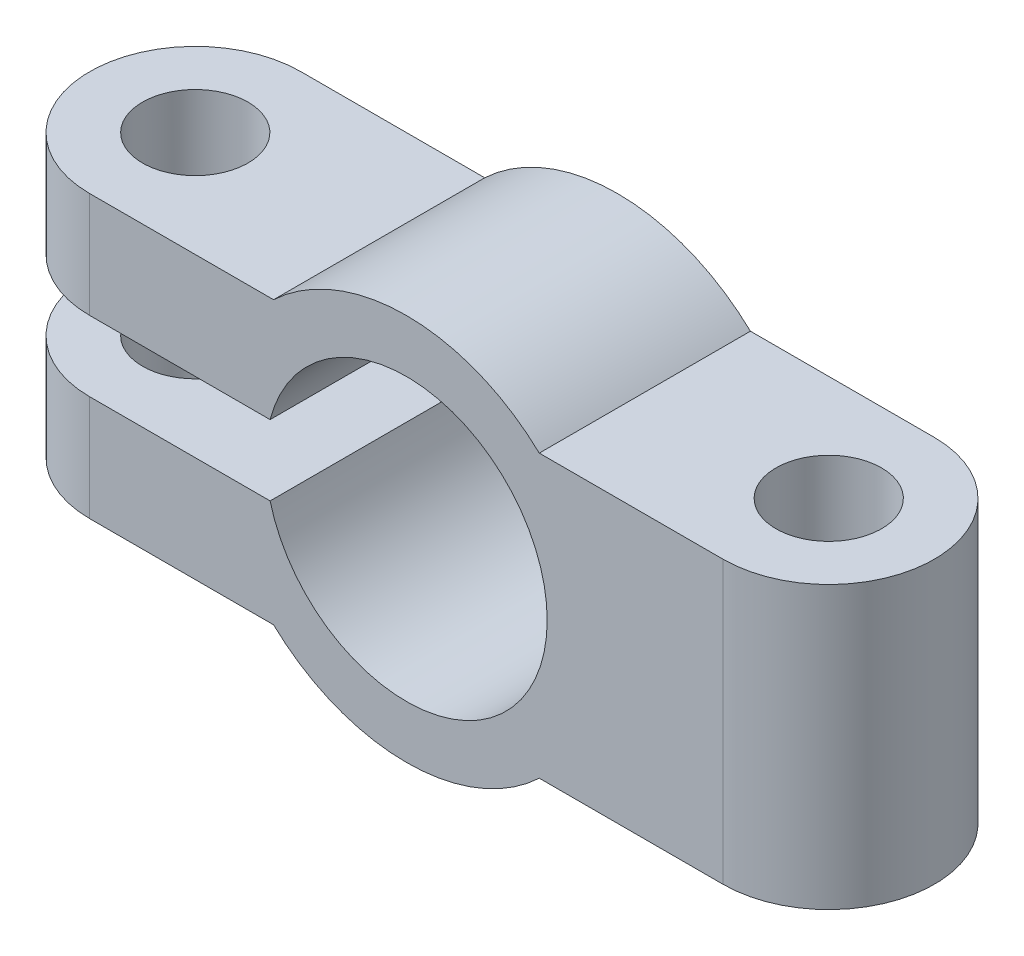
ISO-10303-21;
HEADER;
FILE_DESCRIPTION(('STEP AP214'),'2;1');
FILE_NAME('part.step','',(''),(''),'','','');
FILE_SCHEMA(('AUTOMOTIVE_DESIGN { 1 0 10303 214 1 1 1 1 }'));
ENDSEC;
DATA;
#1=APPLICATION_CONTEXT('core data for automotive mechanical design processes');
#2=APPLICATION_PROTOCOL_DEFINITION('international standard','automotive_design',2000,#1);
#3=PRODUCT_CONTEXT('',#1,'mechanical');
#4=PRODUCT('Part','Part','',(#3));
#5=PRODUCT_RELATED_PRODUCT_CATEGORY('part','',(#4));
#6=PRODUCT_DEFINITION_FORMATION('','',#4);
#7=PRODUCT_DEFINITION_CONTEXT('part definition',#1,'design');
#8=PRODUCT_DEFINITION('design','',#6,#7);
#9=PRODUCT_DEFINITION_SHAPE('','',#8);
#10=(LENGTH_UNIT() NAMED_UNIT(*) SI_UNIT(.MILLI.,.METRE.));
#11=(NAMED_UNIT(*) PLANE_ANGLE_UNIT() SI_UNIT($,.RADIAN.));
#12=(NAMED_UNIT(*) SI_UNIT($,.STERADIAN.) SOLID_ANGLE_UNIT());
#13=UNCERTAINTY_MEASURE_WITH_UNIT(LENGTH_MEASURE(1.E-05),#10,'distance_accuracy_value','');
#14=(GEOMETRIC_REPRESENTATION_CONTEXT(3) GLOBAL_UNCERTAINTY_ASSIGNED_CONTEXT((#13)) GLOBAL_UNIT_ASSIGNED_CONTEXT((#10,
#11,#12)) REPRESENTATION_CONTEXT('',''));
#15=CARTESIAN_POINT('',(0.,0.,0.));
#16=DIRECTION('',(0.,0.,1.));
#17=DIRECTION('',(1.,0.,0.));
#18=AXIS2_PLACEMENT_3D('',#15,#16,#17);
#19=CARTESIAN_POINT('',(12.,4.,6.));
#20=DIRECTION('',(0.,-1.,0.));
#21=DIRECTION('',(0.,0.,-1.));
#22=AXIS2_PLACEMENT_3D('',#19,#20,#21);
#23=PLANE('',#22);
#24=CARTESIAN_POINT('',(9.00000000000001,4.,3.));
#25=DIRECTION('',(0.,-1.,0.));
#26=DIRECTION('',(0.,0.,-1.));
#27=AXIS2_PLACEMENT_3D('',#24,#25,#26);
#28=CIRCLE('',#27,1.5);
#29=CARTESIAN_POINT('',(9.00000000000001,4.,1.5));
#30=VERTEX_POINT('',#29);
#31=EDGE_CURVE('E246',#30,#30,#28,.T.);
#32=ORIENTED_EDGE('',*,*,#31,.T.);
#33=EDGE_LOOP('',(#32));
#34=FACE_BOUND('',#33,.T.);
#35=DIRECTION('',(-1.,0.,0.));
#36=VECTOR('',#35,1.);
#37=CARTESIAN_POINT('',(12.,4.,6.));
#38=LINE('',#37,#36);
#39=CARTESIAN_POINT('',(9.00000000000001,4.,6.));
#40=VERTEX_POINT('',#39);
#41=CARTESIAN_POINT('',(3.77491721763537,4.,6.));
#42=VERTEX_POINT('',#41);
#43=EDGE_CURVE('E170',#40,#42,#38,.T.);
#44=ORIENTED_EDGE('',*,*,#43,.F.);
#45=CARTESIAN_POINT('',(9.00000000000001,4.,3.));
#46=DIRECTION('',(0.,-1.,0.));
#47=DIRECTION('',(0.,0.,-1.));
#48=AXIS2_PLACEMENT_3D('',#45,#46,#47);
#49=CIRCLE('',#48,3.);
#50=CARTESIAN_POINT('',(9.00000000000001,4.,0.));
#51=VERTEX_POINT('',#50);
#52=EDGE_CURVE('E137',#51,#40,#49,.T.);
#53=ORIENTED_EDGE('',*,*,#52,.F.);
#54=DIRECTION('',(-1.,0.,0.));
#55=VECTOR('',#54,1.);
#56=CARTESIAN_POINT('',(12.,4.,0.));
#57=LINE('',#56,#55);
#58=CARTESIAN_POINT('',(3.77491721763537,4.,0.));
#59=VERTEX_POINT('',#58);
#60=EDGE_CURVE('E152',#51,#59,#57,.T.);
#61=ORIENTED_EDGE('',*,*,#60,.T.);
#62=DIRECTION('',(0.,0.,-1.));
#63=VECTOR('',#62,1.);
#64=CARTESIAN_POINT('',(3.77491721763537,4.,6.));
#65=LINE('',#64,#63);
#66=EDGE_CURVE('E183',#42,#59,#65,.T.);
#67=ORIENTED_EDGE('',*,*,#66,.F.);
#68=EDGE_LOOP('',(#44,#53,#61,#67));
#69=FACE_BOUND('',#68,.T.);
#70=ADVANCED_FACE('F34',(#34,#69),#23,.F.);
#71=CARTESIAN_POINT('',(12.,-4.,6.));
#72=DIRECTION('',(0.,1.,0.));
#73=DIRECTION('',(-1.,0.,0.));
#74=AXIS2_PLACEMENT_3D('',#71,#72,#73);
#75=PLANE('',#74);
#76=CARTESIAN_POINT('',(9.00000000000001,-4.,3.));
#77=DIRECTION('',(0.,-1.,0.));
#78=DIRECTION('',(0.,0.,-1.));
#79=AXIS2_PLACEMENT_3D('',#76,#77,#78);
#80=CIRCLE('',#79,1.5);
#81=CARTESIAN_POINT('',(9.00000000000001,-4.,1.5));
#82=VERTEX_POINT('',#81);
#83=EDGE_CURVE('E249',#82,#82,#80,.T.);
#84=ORIENTED_EDGE('',*,*,#83,.F.);
#85=EDGE_LOOP('',(#84));
#86=FACE_BOUND('',#85,.T.);
#87=CARTESIAN_POINT('',(9.00000000000001,-4.,3.));
#88=DIRECTION('',(0.,-1.,0.));
#89=DIRECTION('',(0.,0.,-1.));
#90=AXIS2_PLACEMENT_3D('',#87,#88,#89);
#91=CIRCLE('',#90,3.);
#92=CARTESIAN_POINT('',(9.00000000000001,-4.,0.));
#93=VERTEX_POINT('',#92);
#94=CARTESIAN_POINT('',(9.00000000000001,-4.,6.));
#95=VERTEX_POINT('',#94);
#96=EDGE_CURVE('E122',#93,#95,#91,.T.);
#97=ORIENTED_EDGE('',*,*,#96,.T.);
#98=DIRECTION('',(1.,0.,0.));
#99=VECTOR('',#98,1.);
#100=CARTESIAN_POINT('',(12.,-4.,6.));
#101=LINE('',#100,#99);
#102=CARTESIAN_POINT('',(3.77491721763537,-4.,6.));
#103=VERTEX_POINT('',#102);
#104=EDGE_CURVE('E126',#103,#95,#101,.T.);
#105=ORIENTED_EDGE('',*,*,#104,.F.);
#106=DIRECTION('',(0.,0.,-1.));
#107=VECTOR('',#106,1.);
#108=CARTESIAN_POINT('',(3.77491721763537,-4.,6.));
#109=LINE('',#108,#107);
#110=CARTESIAN_POINT('',(3.77491721763537,-4.,0.));
#111=VERTEX_POINT('',#110);
#112=EDGE_CURVE('E144',#103,#111,#109,.T.);
#113=ORIENTED_EDGE('',*,*,#112,.T.);
#114=DIRECTION('',(1.,0.,0.));
#115=VECTOR('',#114,1.);
#116=CARTESIAN_POINT('',(12.,-4.,0.));
#117=LINE('',#116,#115);
#118=EDGE_CURVE('E128',#111,#93,#117,.T.);
#119=ORIENTED_EDGE('',*,*,#118,.T.);
#120=EDGE_LOOP('',(#97,#105,#113,#119));
#121=FACE_BOUND('',#120,.T.);
#122=ADVANCED_FACE('F123',(#86,#121),#75,.F.);
#123=CARTESIAN_POINT('',(-12.,4.,6.));
#124=DIRECTION('',(0.,-1.,0.));
#125=DIRECTION('',(0.,0.,-1.));
#126=AXIS2_PLACEMENT_3D('',#123,#124,#125);
#127=PLANE('',#126);
#128=CARTESIAN_POINT('',(-9.,4.,3.));
#129=DIRECTION('',(0.,-1.,0.));
#130=DIRECTION('',(0.,0.,-1.));
#131=AXIS2_PLACEMENT_3D('',#128,#129,#130);
#132=CIRCLE('',#131,1.5);
#133=CARTESIAN_POINT('',(-9.,4.,1.5));
#134=VERTEX_POINT('',#133);
#135=EDGE_CURVE('E132',#134,#134,#132,.T.);
#136=ORIENTED_EDGE('',*,*,#135,.T.);
#137=EDGE_LOOP('',(#136));
#138=FACE_BOUND('',#137,.T.);
#139=CARTESIAN_POINT('',(-9.,4.,3.));
#140=DIRECTION('',(0.,-1.,0.));
#141=DIRECTION('',(0.,0.,-1.));
#142=AXIS2_PLACEMENT_3D('',#139,#140,#141);
#143=CIRCLE('',#142,3.);
#144=CARTESIAN_POINT('',(-9.,4.,6.));
#145=VERTEX_POINT('',#144);
#146=CARTESIAN_POINT('',(-9.,4.,0.));
#147=VERTEX_POINT('',#146);
#148=EDGE_CURVE('E48',#145,#147,#143,.T.);
#149=ORIENTED_EDGE('',*,*,#148,.F.);
#150=DIRECTION('',(-1.,0.,0.));
#151=VECTOR('',#150,1.);
#152=CARTESIAN_POINT('',(-12.,4.,6.));
#153=LINE('',#152,#151);
#154=CARTESIAN_POINT('',(-3.77491721763537,4.,6.));
#155=VERTEX_POINT('',#154);
#156=EDGE_CURVE('E222',#155,#145,#153,.T.);
#157=ORIENTED_EDGE('',*,*,#156,.F.);
#158=DIRECTION('',(0.,0.,-1.));
#159=VECTOR('',#158,1.);
#160=CARTESIAN_POINT('',(-3.77491721763537,4.,6.));
#161=LINE('',#160,#159);
#162=CARTESIAN_POINT('',(-3.77491721763537,4.,0.));
#163=VERTEX_POINT('',#162);
#164=EDGE_CURVE('E180',#155,#163,#161,.T.);
#165=ORIENTED_EDGE('',*,*,#164,.T.);
#166=DIRECTION('',(-1.,0.,0.));
#167=VECTOR('',#166,1.);
#168=CARTESIAN_POINT('',(-12.,4.,0.));
#169=LINE('',#168,#167);
#170=EDGE_CURVE('E156',#163,#147,#169,.T.);
#171=ORIENTED_EDGE('',*,*,#170,.T.);
#172=EDGE_LOOP('',(#149,#157,#165,#171));
#173=FACE_BOUND('',#172,.T.);
#174=ADVANCED_FACE('F257',(#138,#173),#127,.F.);
#175=CARTESIAN_POINT('',(-12.,1.,6.));
#176=DIRECTION('',(0.,1.,0.));
#177=DIRECTION('',(0.,0.,1.));
#178=AXIS2_PLACEMENT_3D('',#175,#176,#177);
#179=PLANE('',#178);
#180=CARTESIAN_POINT('',(-9.,1.,3.));
#181=DIRECTION('',(0.,1.,0.));
#182=DIRECTION('',(0.,0.,1.));
#183=AXIS2_PLACEMENT_3D('',#180,#181,#182);
#184=CIRCLE('',#183,1.5);
#185=CARTESIAN_POINT('',(-9.,1.,4.5));
#186=VERTEX_POINT('',#185);
#187=EDGE_CURVE('E237',#186,#186,#184,.T.);
#188=ORIENTED_EDGE('',*,*,#187,.T.);
#189=EDGE_LOOP('',(#188));
#190=FACE_BOUND('',#189,.T.);
#191=DIRECTION('',(1.,0.,0.));
#192=VECTOR('',#191,1.);
#193=CARTESIAN_POINT('',(-12.,1.,6.));
#194=LINE('',#193,#192);
#195=CARTESIAN_POINT('',(-9.,0.999999999999998,6.));
#196=VERTEX_POINT('',#195);
#197=CARTESIAN_POINT('',(-3.87298334620742,0.999999999999998,6.));
#198=VERTEX_POINT('',#197);
#199=EDGE_CURVE('E203',#196,#198,#194,.T.);
#200=ORIENTED_EDGE('',*,*,#199,.F.);
#201=CARTESIAN_POINT('',(-9.,1.,3.));
#202=DIRECTION('',(0.,1.,0.));
#203=DIRECTION('',(0.,0.,1.));
#204=AXIS2_PLACEMENT_3D('',#201,#202,#203);
#205=CIRCLE('',#204,3.);
#206=CARTESIAN_POINT('',(-9.,0.999999999999998,0.));
#207=VERTEX_POINT('',#206);
#208=EDGE_CURVE('E195',#207,#196,#205,.T.);
#209=ORIENTED_EDGE('',*,*,#208,.F.);
#210=DIRECTION('',(1.,0.,0.));
#211=VECTOR('',#210,1.);
#212=CARTESIAN_POINT('',(-12.,1.,0.));
#213=LINE('',#212,#211);
#214=CARTESIAN_POINT('',(-3.87298334620742,0.999999999999998,0.));
#215=VERTEX_POINT('',#214);
#216=EDGE_CURVE('E159',#207,#215,#213,.T.);
#217=ORIENTED_EDGE('',*,*,#216,.T.);
#218=DIRECTION('',(0.,0.,-1.));
#219=VECTOR('',#218,1.);
#220=CARTESIAN_POINT('',(-3.87298334620742,0.999999999999998,6.));
#221=LINE('',#220,#219);
#222=EDGE_CURVE('E177',#198,#215,#221,.T.);
#223=ORIENTED_EDGE('',*,*,#222,.F.);
#224=EDGE_LOOP('',(#200,#209,#217,#223));
#225=FACE_BOUND('',#224,.T.);
#226=ADVANCED_FACE('F201',(#190,#225),#179,.F.);
#227=CARTESIAN_POINT('',(-12.,-1.,6.));
#228=DIRECTION('',(0.,-1.,0.));
#229=DIRECTION('',(1.,0.,0.));
#230=AXIS2_PLACEMENT_3D('',#227,#228,#229);
#231=PLANE('',#230);
#232=CARTESIAN_POINT('',(-9.,-1.,3.));
#233=DIRECTION('',(0.,-1.,0.));
#234=DIRECTION('',(1.,0.,0.));
#235=AXIS2_PLACEMENT_3D('',#232,#233,#234);
#236=CIRCLE('',#235,1.5);
#237=CARTESIAN_POINT('',(-7.5,-1.,3.));
#238=VERTEX_POINT('',#237);
#239=EDGE_CURVE('E240',#238,#238,#236,.T.);
#240=ORIENTED_EDGE('',*,*,#239,.T.);
#241=EDGE_LOOP('',(#240));
#242=FACE_BOUND('',#241,.T.);
#243=CARTESIAN_POINT('',(-9.,-1.,3.));
#244=DIRECTION('',(0.,-1.,0.));
#245=DIRECTION('',(1.,0.,0.));
#246=AXIS2_PLACEMENT_3D('',#243,#244,#245);
#247=CIRCLE('',#246,3.);
#248=CARTESIAN_POINT('',(-9.,-1.,6.));
#249=VERTEX_POINT('',#248);
#250=CARTESIAN_POINT('',(-9.,-1.,0.));
#251=VERTEX_POINT('',#250);
#252=EDGE_CURVE('E56',#249,#251,#247,.T.);
#253=ORIENTED_EDGE('',*,*,#252,.F.);
#254=DIRECTION('',(-1.,0.,0.));
#255=VECTOR('',#254,1.);
#256=CARTESIAN_POINT('',(-12.,-1.,6.));
#257=LINE('',#256,#255);
#258=CARTESIAN_POINT('',(-3.87298334620742,-1.,6.));
#259=VERTEX_POINT('',#258);
#260=EDGE_CURVE('E216',#259,#249,#257,.T.);
#261=ORIENTED_EDGE('',*,*,#260,.F.);
#262=DIRECTION('',(0.,0.,-1.));
#263=VECTOR('',#262,1.);
#264=CARTESIAN_POINT('',(-3.87298334620742,-1.,6.));
#265=LINE('',#264,#263);
#266=CARTESIAN_POINT('',(-3.87298334620742,-1.,0.));
#267=VERTEX_POINT('',#266);
#268=EDGE_CURVE('E174',#259,#267,#265,.T.);
#269=ORIENTED_EDGE('',*,*,#268,.T.);
#270=DIRECTION('',(-1.,0.,0.));
#271=VECTOR('',#270,1.);
#272=CARTESIAN_POINT('',(-12.,-1.,0.));
#273=LINE('',#272,#271);
#274=EDGE_CURVE('E163',#267,#251,#273,.T.);
#275=ORIENTED_EDGE('',*,*,#274,.T.);
#276=EDGE_LOOP('',(#253,#261,#269,#275));
#277=FACE_BOUND('',#276,.T.);
#278=ADVANCED_FACE('F215',(#242,#277),#231,.F.);
#279=CARTESIAN_POINT('',(-12.,-4.,6.));
#280=DIRECTION('',(0.,1.,0.));
#281=DIRECTION('',(0.,0.,1.));
#282=AXIS2_PLACEMENT_3D('',#279,#280,#281);
#283=PLANE('',#282);
#284=CARTESIAN_POINT('',(-9.,-4.,3.));
#285=DIRECTION('',(0.,-1.,0.));
#286=DIRECTION('',(0.,0.,-1.));
#287=AXIS2_PLACEMENT_3D('',#284,#285,#286);
#288=CIRCLE('',#287,1.5);
#289=CARTESIAN_POINT('',(-9.,-4.,1.5));
#290=VERTEX_POINT('',#289);
#291=EDGE_CURVE('E243',#290,#290,#288,.T.);
#292=ORIENTED_EDGE('',*,*,#291,.F.);
#293=EDGE_LOOP('',(#292));
#294=FACE_BOUND('',#293,.T.);
#295=DIRECTION('',(1.,0.,0.));
#296=VECTOR('',#295,1.);
#297=CARTESIAN_POINT('',(-12.,-4.,6.));
#298=LINE('',#297,#296);
#299=CARTESIAN_POINT('',(-9.,-4.,6.));
#300=VERTEX_POINT('',#299);
#301=CARTESIAN_POINT('',(-3.77491721763537,-4.,6.));
#302=VERTEX_POINT('',#301);
#303=EDGE_CURVE('E148',#300,#302,#298,.T.);
#304=ORIENTED_EDGE('',*,*,#303,.F.);
#305=CARTESIAN_POINT('',(-9.,-4.,3.));
#306=DIRECTION('',(0.,-1.,0.));
#307=DIRECTION('',(0.,0.,-1.));
#308=AXIS2_PLACEMENT_3D('',#305,#306,#307);
#309=CIRCLE('',#308,3.);
#310=CARTESIAN_POINT('',(-9.,-4.,0.));
#311=VERTEX_POINT('',#310);
#312=EDGE_CURVE('E230',#300,#311,#309,.T.);
#313=ORIENTED_EDGE('',*,*,#312,.T.);
#314=DIRECTION('',(1.,0.,0.));
#315=VECTOR('',#314,1.);
#316=CARTESIAN_POINT('',(-12.,-4.,0.));
#317=LINE('',#316,#315);
#318=CARTESIAN_POINT('',(-3.77491721763537,-4.,0.));
#319=VERTEX_POINT('',#318);
#320=EDGE_CURVE('E166',#311,#319,#317,.T.);
#321=ORIENTED_EDGE('',*,*,#320,.T.);
#322=DIRECTION('',(0.,0.,-1.));
#323=VECTOR('',#322,1.);
#324=CARTESIAN_POINT('',(-3.77491721763537,-4.,6.));
#325=LINE('',#324,#323);
#326=EDGE_CURVE('E146',#302,#319,#325,.T.);
#327=ORIENTED_EDGE('',*,*,#326,.F.);
#328=EDGE_LOOP('',(#304,#313,#321,#327));
#329=FACE_BOUND('',#328,.T.);
#330=ADVANCED_FACE('F274',(#294,#329),#283,.F.);
#331=CARTESIAN_POINT('',(0.,0.,6.));
#332=DIRECTION('',(0.,0.,1.));
#333=DIRECTION('',(1.,0.,0.));
#334=AXIS2_PLACEMENT_3D('',#331,#332,#333);
#335=PLANE('',#334);
#336=DIRECTION('',(0.,-1.,0.));
#337=VECTOR('',#336,1.);
#338=CARTESIAN_POINT('',(9.00000000000001,5.5,6.));
#339=LINE('',#338,#337);
#340=EDGE_CURVE('E11',#40,#95,#339,.T.);
#341=ORIENTED_EDGE('',*,*,#340,.F.);
#342=ORIENTED_EDGE('',*,*,#43,.T.);
#343=CARTESIAN_POINT('',(0.,0.,6.));
#344=DIRECTION('',(0.,0.,1.));
#345=DIRECTION('',(1.,0.,0.));
#346=AXIS2_PLACEMENT_3D('',#343,#344,#345);
#347=CIRCLE('',#346,5.5);
#348=EDGE_CURVE('E225',#42,#155,#347,.T.);
#349=ORIENTED_EDGE('',*,*,#348,.T.);
#350=ORIENTED_EDGE('',*,*,#156,.T.);
#351=DIRECTION('',(0.,-1.,0.));
#352=VECTOR('',#351,1.);
#353=CARTESIAN_POINT('',(-9.,5.5,6.));
#354=LINE('',#353,#352);
#355=EDGE_CURVE('E41',#145,#196,#354,.T.);
#356=ORIENTED_EDGE('',*,*,#355,.T.);
#357=ORIENTED_EDGE('',*,*,#199,.T.);
#358=CARTESIAN_POINT('',(0.,0.,6.));
#359=DIRECTION('',(0.,0.,-1.));
#360=DIRECTION('',(1.,0.,0.));
#361=AXIS2_PLACEMENT_3D('',#358,#359,#360);
#362=CIRCLE('',#361,4.);
#363=EDGE_CURVE('E217',#198,#259,#362,.T.);
#364=ORIENTED_EDGE('',*,*,#363,.T.);
#365=ORIENTED_EDGE('',*,*,#260,.T.);
#366=EDGE_CURVE('E188',#249,#300,#354,.T.);
#367=ORIENTED_EDGE('',*,*,#366,.T.);
#368=ORIENTED_EDGE('',*,*,#303,.T.);
#369=CARTESIAN_POINT('',(0.,0.,6.));
#370=DIRECTION('',(0.,0.,1.));
#371=DIRECTION('',(1.,0.,0.));
#372=AXIS2_PLACEMENT_3D('',#369,#370,#371);
#373=CIRCLE('',#372,5.5);
#374=EDGE_CURVE('E142',#302,#103,#373,.T.);
#375=ORIENTED_EDGE('',*,*,#374,.T.);
#376=ORIENTED_EDGE('',*,*,#104,.T.);
#377=EDGE_LOOP('',(#341,#342,#349,#350,#356,#357,#364,#365,#367,#368,#375,#376));
#378=FACE_BOUND('',#377,.T.);
#379=ADVANCED_FACE('F140',(#378),#335,.T.);
#380=CARTESIAN_POINT('',(0.,0.,0.));
#381=DIRECTION('',(0.,0.,1.));
#382=DIRECTION('',(1.,0.,0.));
#383=AXIS2_PLACEMENT_3D('',#380,#381,#382);
#384=PLANE('',#383);
#385=ORIENTED_EDGE('',*,*,#60,.F.);
#386=DIRECTION('',(0.,-1.,0.));
#387=VECTOR('',#386,1.);
#388=CARTESIAN_POINT('',(9.00000000000001,5.5,0.));
#389=LINE('',#388,#387);
#390=EDGE_CURVE('E131',#51,#93,#389,.T.);
#391=ORIENTED_EDGE('',*,*,#390,.T.);
#392=ORIENTED_EDGE('',*,*,#118,.F.);
#393=CARTESIAN_POINT('',(0.,0.,0.));
#394=DIRECTION('',(0.,0.,1.));
#395=DIRECTION('',(1.,0.,0.));
#396=AXIS2_PLACEMENT_3D('',#393,#394,#395);
#397=CIRCLE('',#396,5.5);
#398=EDGE_CURVE('E168',#319,#111,#397,.T.);
#399=ORIENTED_EDGE('',*,*,#398,.F.);
#400=ORIENTED_EDGE('',*,*,#320,.F.);
#401=DIRECTION('',(0.,-1.,0.));
#402=VECTOR('',#401,1.);
#403=CARTESIAN_POINT('',(-9.,5.5,0.));
#404=LINE('',#403,#402);
#405=EDGE_CURVE('E186',#251,#311,#404,.T.);
#406=ORIENTED_EDGE('',*,*,#405,.F.);
#407=ORIENTED_EDGE('',*,*,#274,.F.);
#408=CARTESIAN_POINT('',(0.,0.,0.));
#409=DIRECTION('',(0.,0.,-1.));
#410=DIRECTION('',(1.,0.,0.));
#411=AXIS2_PLACEMENT_3D('',#408,#409,#410);
#412=CIRCLE('',#411,4.);
#413=EDGE_CURVE('E161',#215,#267,#412,.T.);
#414=ORIENTED_EDGE('',*,*,#413,.F.);
#415=ORIENTED_EDGE('',*,*,#216,.F.);
#416=EDGE_CURVE('E187',#147,#207,#404,.T.);
#417=ORIENTED_EDGE('',*,*,#416,.F.);
#418=ORIENTED_EDGE('',*,*,#170,.F.);
#419=CARTESIAN_POINT('',(0.,0.,0.));
#420=DIRECTION('',(0.,0.,1.));
#421=DIRECTION('',(1.,0.,0.));
#422=AXIS2_PLACEMENT_3D('',#419,#420,#421);
#423=CIRCLE('',#422,5.5);
#424=EDGE_CURVE('E154',#59,#163,#423,.T.);
#425=ORIENTED_EDGE('',*,*,#424,.F.);
#426=EDGE_LOOP('',(#385,#391,#392,#399,#400,#406,#407,#414,#415,#417,#418,#425));
#427=FACE_BOUND('',#426,.T.);
#428=ADVANCED_FACE('F207',(#427),#384,.F.);
#429=CARTESIAN_POINT('',(0.,0.,6.));
#430=DIRECTION('',(0.,0.,-1.));
#431=DIRECTION('',(-1.,0.,0.));
#432=AXIS2_PLACEMENT_3D('',#429,#430,#431);
#433=CYLINDRICAL_SURFACE('',#432,5.5);
#434=ORIENTED_EDGE('',*,*,#424,.T.);
#435=ORIENTED_EDGE('',*,*,#164,.F.);
#436=ORIENTED_EDGE('',*,*,#348,.F.);
#437=ORIENTED_EDGE('',*,*,#66,.T.);
#438=EDGE_LOOP('',(#434,#435,#436,#437));
#439=FACE_BOUND('',#438,.T.);
#440=ADVANCED_FACE('F283',(#439),#433,.T.);
#441=CARTESIAN_POINT('',(0.,0.,6.));
#442=DIRECTION('',(0.,0.,-1.));
#443=DIRECTION('',(-1.,0.,0.));
#444=AXIS2_PLACEMENT_3D('',#441,#442,#443);
#445=CYLINDRICAL_SURFACE('',#444,4.);
#446=ORIENTED_EDGE('',*,*,#413,.T.);
#447=ORIENTED_EDGE('',*,*,#268,.F.);
#448=ORIENTED_EDGE('',*,*,#363,.F.);
#449=ORIENTED_EDGE('',*,*,#222,.T.);
#450=EDGE_LOOP('',(#446,#447,#448,#449));
#451=FACE_BOUND('',#450,.T.);
#452=ADVANCED_FACE('F211',(#451),#445,.F.);
#453=CARTESIAN_POINT('',(0.,0.,6.));
#454=DIRECTION('',(0.,0.,-1.));
#455=DIRECTION('',(-1.,0.,0.));
#456=AXIS2_PLACEMENT_3D('',#453,#454,#455);
#457=CYLINDRICAL_SURFACE('',#456,5.5);
#458=ORIENTED_EDGE('',*,*,#398,.T.);
#459=ORIENTED_EDGE('',*,*,#112,.F.);
#460=ORIENTED_EDGE('',*,*,#374,.F.);
#461=ORIENTED_EDGE('',*,*,#326,.T.);
#462=EDGE_LOOP('',(#458,#459,#460,#461));
#463=FACE_BOUND('',#462,.T.);
#464=ADVANCED_FACE('F269',(#463),#457,.T.);
#465=CARTESIAN_POINT('',(-9.,5.5,3.));
#466=DIRECTION('',(0.,-1.,0.));
#467=DIRECTION('',(0.,0.,-1.));
#468=AXIS2_PLACEMENT_3D('',#465,#466,#467);
#469=CYLINDRICAL_SURFACE('',#468,3.);
#470=ORIENTED_EDGE('',*,*,#252,.T.);
#471=ORIENTED_EDGE('',*,*,#405,.T.);
#472=ORIENTED_EDGE('',*,*,#312,.F.);
#473=ORIENTED_EDGE('',*,*,#366,.F.);
#474=EDGE_LOOP('',(#470,#471,#472,#473));
#475=FACE_BOUND('',#474,.T.);
#476=ADVANCED_FACE('F272',(#475),#469,.T.);
#477=ORIENTED_EDGE('',*,*,#148,.T.);
#478=ORIENTED_EDGE('',*,*,#416,.T.);
#479=ORIENTED_EDGE('',*,*,#208,.T.);
#480=ORIENTED_EDGE('',*,*,#355,.F.);
#481=EDGE_LOOP('',(#477,#478,#479,#480));
#482=FACE_BOUND('',#481,.T.);
#483=ADVANCED_FACE('F194',(#482),#469,.T.);
#484=CARTESIAN_POINT('',(9.00000000000001,5.5,3.));
#485=DIRECTION('',(0.,-1.,0.));
#486=DIRECTION('',(0.,0.,-1.));
#487=AXIS2_PLACEMENT_3D('',#484,#485,#486);
#488=CYLINDRICAL_SURFACE('',#487,3.);
#489=ORIENTED_EDGE('',*,*,#52,.T.);
#490=ORIENTED_EDGE('',*,*,#340,.T.);
#491=ORIENTED_EDGE('',*,*,#96,.F.);
#492=ORIENTED_EDGE('',*,*,#390,.F.);
#493=EDGE_LOOP('',(#489,#490,#491,#492));
#494=FACE_BOUND('',#493,.T.);
#495=ADVANCED_FACE('F135',(#494),#488,.T.);
#496=CARTESIAN_POINT('',(-9.,5.5,3.));
#497=DIRECTION('',(0.,-1.,0.));
#498=DIRECTION('',(0.,0.,-1.));
#499=AXIS2_PLACEMENT_3D('',#496,#497,#498);
#500=CYLINDRICAL_SURFACE('',#499,1.5);
#501=ORIENTED_EDGE('',*,*,#291,.T.);
#502=EDGE_LOOP('',(#501));
#503=FACE_BOUND('',#502,.T.);
#504=ORIENTED_EDGE('',*,*,#239,.F.);
#505=EDGE_LOOP('',(#504));
#506=FACE_BOUND('',#505,.T.);
#507=ADVANCED_FACE('F342',(#503,#506),#500,.F.);
#508=ORIENTED_EDGE('',*,*,#187,.F.);
#509=EDGE_LOOP('',(#508));
#510=FACE_BOUND('',#509,.T.);
#511=ORIENTED_EDGE('',*,*,#135,.F.);
#512=EDGE_LOOP('',(#511));
#513=FACE_BOUND('',#512,.T.);
#514=ADVANCED_FACE('F382',(#510,#513),#500,.F.);
#515=CARTESIAN_POINT('',(9.00000000000001,5.5,3.));
#516=DIRECTION('',(0.,-1.,0.));
#517=DIRECTION('',(0.,0.,-1.));
#518=AXIS2_PLACEMENT_3D('',#515,#516,#517);
#519=CYLINDRICAL_SURFACE('',#518,1.5);
#520=ORIENTED_EDGE('',*,*,#83,.T.);
#521=EDGE_LOOP('',(#520));
#522=FACE_BOUND('',#521,.T.);
#523=ORIENTED_EDGE('',*,*,#31,.F.);
#524=EDGE_LOOP('',(#523));
#525=FACE_BOUND('',#524,.T.);
#526=ADVANCED_FACE('F253',(#522,#525),#519,.F.);
#527=CLOSED_SHELL('',(#70,#122,#174,#226,#278,#330,#379,#428,#440,#452,#464,#476,#483,#495,#507,
#514,#526));
#528=MANIFOLD_SOLID_BREP('B2',#527);
#529=ADVANCED_BREP_SHAPE_REPRESENTATION('',(#18,#528),#14);
#530=SHAPE_DEFINITION_REPRESENTATION(#9,#529);
ENDSEC;
END-ISO-10303-21;
